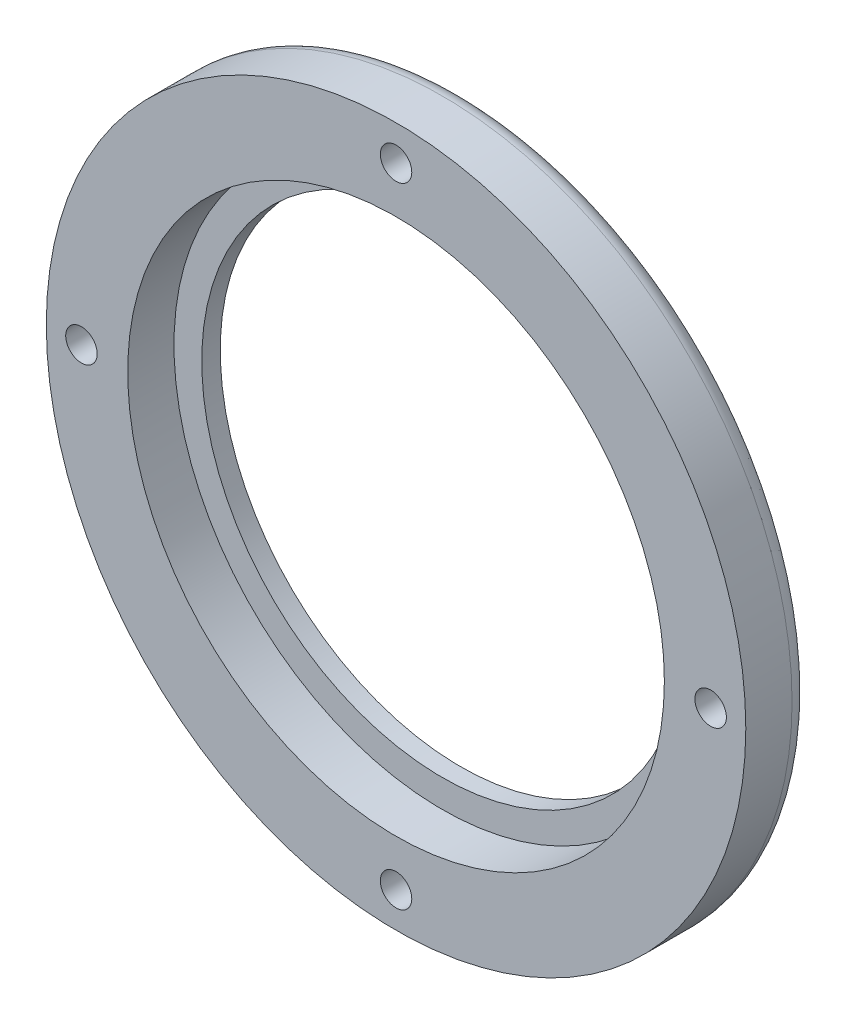
ISO-10303-21;
HEADER;
FILE_DESCRIPTION(('STEP AP214'),'2;1');
FILE_NAME('part.step','',(''),(''),'','','');
FILE_SCHEMA(('AUTOMOTIVE_DESIGN { 1 0 10303 214 1 1 1 1 }'));
ENDSEC;
DATA;
#1=APPLICATION_CONTEXT('core data for automotive mechanical design processes');
#2=APPLICATION_PROTOCOL_DEFINITION('international standard','automotive_design',2000,#1);
#3=PRODUCT_CONTEXT('',#1,'mechanical');
#4=PRODUCT('Part','Part','',(#3));
#5=PRODUCT_RELATED_PRODUCT_CATEGORY('part','',(#4));
#6=PRODUCT_DEFINITION_FORMATION('','',#4);
#7=PRODUCT_DEFINITION_CONTEXT('part definition',#1,'design');
#8=PRODUCT_DEFINITION('design','',#6,#7);
#9=PRODUCT_DEFINITION_SHAPE('','',#8);
#10=(LENGTH_UNIT() NAMED_UNIT(*) SI_UNIT(.MILLI.,.METRE.));
#11=(NAMED_UNIT(*) PLANE_ANGLE_UNIT() SI_UNIT($,.RADIAN.));
#12=(NAMED_UNIT(*) SI_UNIT($,.STERADIAN.) SOLID_ANGLE_UNIT());
#13=UNCERTAINTY_MEASURE_WITH_UNIT(LENGTH_MEASURE(1.E-05),#10,'distance_accuracy_value','');
#14=(GEOMETRIC_REPRESENTATION_CONTEXT(3) GLOBAL_UNCERTAINTY_ASSIGNED_CONTEXT((#13)) GLOBAL_UNIT_ASSIGNED_CONTEXT((#10,
#11,#12)) REPRESENTATION_CONTEXT('',''));
#15=CARTESIAN_POINT('',(0.,0.,0.));
#16=DIRECTION('',(0.,0.,1.));
#17=DIRECTION('',(1.,0.,0.));
#18=AXIS2_PLACEMENT_3D('',#15,#16,#17);
#19=CARTESIAN_POINT('',(34.,-3.58906191348806E-13,-1.));
#20=DIRECTION('',(0.,0.,1.));
#21=DIRECTION('',(1.,0.,0.));
#22=AXIS2_PLACEMENT_3D('',#19,#20,#21);
#23=CYLINDRICAL_SURFACE('',#22,1.7);
#24=CARTESIAN_POINT('',(34.,-3.58906191348806E-13,7.));
#25=DIRECTION('',(0.,0.,1.));
#26=DIRECTION('',(1.,0.,0.));
#27=AXIS2_PLACEMENT_3D('',#24,#25,#26);
#28=CIRCLE('',#27,1.7);
#29=CARTESIAN_POINT('',(35.7,-3.58906191348806E-13,7.));
#30=VERTEX_POINT('',#29);
#31=EDGE_CURVE('E142',#30,#30,#28,.T.);
#32=ORIENTED_EDGE('',*,*,#31,.T.);
#33=EDGE_LOOP('',(#32));
#34=FACE_BOUND('',#33,.T.);
#35=CARTESIAN_POINT('',(34.,-3.58906191348806E-13,2.5));
#36=DIRECTION('',(0.,0.,-1.));
#37=DIRECTION('',(-1.,0.,0.));
#38=AXIS2_PLACEMENT_3D('',#35,#36,#37);
#39=CIRCLE('',#38,1.7);
#40=CARTESIAN_POINT('',(32.3,-3.58906191348806E-13,2.5));
#41=VERTEX_POINT('',#40);
#42=EDGE_CURVE('E139',#41,#41,#39,.F.);
#43=ORIENTED_EDGE('',*,*,#42,.F.);
#44=EDGE_LOOP('',(#43));
#45=FACE_BOUND('',#44,.T.);
#46=ADVANCED_FACE('F42',(#34,#45),#23,.F.);
#47=CARTESIAN_POINT('',(2.33256931924232E-13,34.,-1.));
#48=DIRECTION('',(0.,0.,1.));
#49=DIRECTION('',(1.,0.,0.));
#50=AXIS2_PLACEMENT_3D('',#47,#48,#49);
#51=CYLINDRICAL_SURFACE('',#50,1.7);
#52=CARTESIAN_POINT('',(2.33256931924232E-13,34.,7.));
#53=DIRECTION('',(0.,0.,1.));
#54=DIRECTION('',(1.,0.,0.));
#55=AXIS2_PLACEMENT_3D('',#52,#53,#54);
#56=CIRCLE('',#55,1.7);
#57=CARTESIAN_POINT('',(1.70000000000023,34.,7.));
#58=VERTEX_POINT('',#57);
#59=EDGE_CURVE('E234',#58,#58,#56,.T.);
#60=ORIENTED_EDGE('',*,*,#59,.T.);
#61=EDGE_LOOP('',(#60));
#62=FACE_BOUND('',#61,.T.);
#63=CARTESIAN_POINT('',(2.33256931924232E-13,34.,2.5));
#64=DIRECTION('',(0.,0.,-1.));
#65=DIRECTION('',(-1.,0.,0.));
#66=AXIS2_PLACEMENT_3D('',#63,#64,#65);
#67=CIRCLE('',#66,1.7);
#68=CARTESIAN_POINT('',(-1.69999999999977,34.,2.5));
#69=VERTEX_POINT('',#68);
#70=EDGE_CURVE('E135',#69,#69,#67,.F.);
#71=ORIENTED_EDGE('',*,*,#70,.F.);
#72=EDGE_LOOP('',(#71));
#73=FACE_BOUND('',#72,.T.);
#74=ADVANCED_FACE('F171',(#62,#73),#51,.F.);
#75=CARTESIAN_POINT('',(-34.,1.21485460307473E-13,-1.));
#76=DIRECTION('',(0.,0.,1.));
#77=DIRECTION('',(1.,0.,0.));
#78=AXIS2_PLACEMENT_3D('',#75,#76,#77);
#79=CYLINDRICAL_SURFACE('',#78,1.7);
#80=CARTESIAN_POINT('',(-34.,1.21485460307473E-13,7.));
#81=DIRECTION('',(0.,0.,1.));
#82=DIRECTION('',(1.,0.,0.));
#83=AXIS2_PLACEMENT_3D('',#80,#81,#82);
#84=CIRCLE('',#83,1.7);
#85=CARTESIAN_POINT('',(-32.3,1.21485460307473E-13,7.));
#86=VERTEX_POINT('',#85);
#87=EDGE_CURVE('E238',#86,#86,#84,.T.);
#88=ORIENTED_EDGE('',*,*,#87,.T.);
#89=EDGE_LOOP('',(#88));
#90=FACE_BOUND('',#89,.T.);
#91=CARTESIAN_POINT('',(-34.,1.21485460307473E-13,2.5));
#92=DIRECTION('',(0.,0.,-1.));
#93=DIRECTION('',(-1.,0.,0.));
#94=AXIS2_PLACEMENT_3D('',#91,#92,#93);
#95=CIRCLE('',#94,1.7);
#96=CARTESIAN_POINT('',(-35.7,1.21485460307473E-13,2.5));
#97=VERTEX_POINT('',#96);
#98=EDGE_CURVE('E130',#97,#97,#95,.F.);
#99=ORIENTED_EDGE('',*,*,#98,.F.);
#100=EDGE_LOOP('',(#99));
#101=FACE_BOUND('',#100,.T.);
#102=ADVANCED_FACE('F167',(#90,#101),#79,.F.);
#103=CARTESIAN_POINT('',(0.,-34.,-1.));
#104=DIRECTION('',(0.,0.,1.));
#105=DIRECTION('',(1.,0.,0.));
#106=AXIS2_PLACEMENT_3D('',#103,#104,#105);
#107=CYLINDRICAL_SURFACE('',#106,1.7);
#108=CARTESIAN_POINT('',(0.,-34.,7.));
#109=DIRECTION('',(0.,0.,1.));
#110=DIRECTION('',(1.,0.,0.));
#111=AXIS2_PLACEMENT_3D('',#108,#109,#110);
#112=CIRCLE('',#111,1.7);
#113=CARTESIAN_POINT('',(1.7,-34.,7.));
#114=VERTEX_POINT('',#113);
#115=EDGE_CURVE('E229',#114,#114,#112,.T.);
#116=ORIENTED_EDGE('',*,*,#115,.T.);
#117=EDGE_LOOP('',(#116));
#118=FACE_BOUND('',#117,.T.);
#119=CARTESIAN_POINT('',(0.,-34.,2.5));
#120=DIRECTION('',(0.,0.,-1.));
#121=DIRECTION('',(-1.,0.,0.));
#122=AXIS2_PLACEMENT_3D('',#119,#120,#121);
#123=CIRCLE('',#122,1.7);
#124=CARTESIAN_POINT('',(-1.7,-34.,2.5));
#125=VERTEX_POINT('',#124);
#126=EDGE_CURVE('E126',#125,#125,#123,.F.);
#127=ORIENTED_EDGE('',*,*,#126,.F.);
#128=EDGE_LOOP('',(#127));
#129=FACE_BOUND('',#128,.T.);
#130=ADVANCED_FACE('F163',(#118,#129),#107,.F.);
#131=CARTESIAN_POINT('',(0.,0.,7.));
#132=DIRECTION('',(0.,0.,-1.));
#133=DIRECTION('',(-1.,0.,0.));
#134=AXIS2_PLACEMENT_3D('',#131,#132,#133);
#135=CYLINDRICAL_SURFACE('',#134,26.);
#136=CARTESIAN_POINT('',(0.,0.,0.));
#137=DIRECTION('',(0.,0.,1.));
#138=DIRECTION('',(1.,0.,0.));
#139=AXIS2_PLACEMENT_3D('',#136,#137,#138);
#140=CIRCLE('',#139,26.);
#141=CARTESIAN_POINT('',(26.,0.,0.));
#142=VERTEX_POINT('',#141);
#143=EDGE_CURVE('E208',#142,#142,#140,.T.);
#144=ORIENTED_EDGE('',*,*,#143,.F.);
#145=EDGE_LOOP('',(#144));
#146=FACE_BOUND('',#145,.T.);
#147=CARTESIAN_POINT('',(0.,0.,2.));
#148=DIRECTION('',(0.,0.,1.));
#149=DIRECTION('',(1.,0.,0.));
#150=AXIS2_PLACEMENT_3D('',#147,#148,#149);
#151=CIRCLE('',#150,26.);
#152=CARTESIAN_POINT('',(26.,0.,2.));
#153=VERTEX_POINT('',#152);
#154=EDGE_CURVE('E213',#153,#153,#151,.T.);
#155=ORIENTED_EDGE('',*,*,#154,.T.);
#156=EDGE_LOOP('',(#155));
#157=FACE_BOUND('',#156,.T.);
#158=ADVANCED_FACE('F166',(#146,#157),#135,.F.);
#159=CARTESIAN_POINT('',(0.,0.,7.));
#160=DIRECTION('',(0.,0.,1.));
#161=DIRECTION('',(1.,0.,0.));
#162=AXIS2_PLACEMENT_3D('',#159,#160,#161);
#163=PLANE('',#162);
#164=ORIENTED_EDGE('',*,*,#115,.F.);
#165=EDGE_LOOP('',(#164));
#166=FACE_BOUND('',#165,.T.);
#167=ORIENTED_EDGE('',*,*,#87,.F.);
#168=EDGE_LOOP('',(#167));
#169=FACE_BOUND('',#168,.T.);
#170=ORIENTED_EDGE('',*,*,#59,.F.);
#171=EDGE_LOOP('',(#170));
#172=FACE_BOUND('',#171,.T.);
#173=ORIENTED_EDGE('',*,*,#31,.F.);
#174=EDGE_LOOP('',(#173));
#175=FACE_BOUND('',#174,.T.);
#176=CARTESIAN_POINT('',(0.,0.,7.));
#177=DIRECTION('',(0.,0.,1.));
#178=DIRECTION('',(1.,0.,0.));
#179=AXIS2_PLACEMENT_3D('',#176,#177,#178);
#180=CIRCLE('',#179,29.);
#181=CARTESIAN_POINT('',(29.,0.,7.));
#182=VERTEX_POINT('',#181);
#183=EDGE_CURVE('E223',#182,#182,#180,.T.);
#184=ORIENTED_EDGE('',*,*,#183,.F.);
#185=EDGE_LOOP('',(#184));
#186=FACE_BOUND('',#185,.T.);
#187=CARTESIAN_POINT('',(0.,0.,7.));
#188=DIRECTION('',(0.,0.,1.));
#189=DIRECTION('',(1.,0.,0.));
#190=AXIS2_PLACEMENT_3D('',#187,#188,#189);
#191=CIRCLE('',#190,37.8);
#192=CARTESIAN_POINT('',(37.8,0.,7.));
#193=VERTEX_POINT('',#192);
#194=EDGE_CURVE('E205',#193,#193,#191,.T.);
#195=ORIENTED_EDGE('',*,*,#194,.T.);
#196=EDGE_LOOP('',(#195));
#197=FACE_BOUND('',#196,.T.);
#198=ADVANCED_FACE('F190',(#166,#169,#172,#175,#186,#197),#163,.T.);
#199=CARTESIAN_POINT('',(0.,0.,0.));
#200=DIRECTION('',(0.,0.,1.));
#201=DIRECTION('',(1.,0.,0.));
#202=AXIS2_PLACEMENT_3D('',#199,#200,#201);
#203=PLANE('',#202);
#204=CARTESIAN_POINT('',(0.,0.,0.));
#205=DIRECTION('',(0.,0.,1.));
#206=DIRECTION('',(1.,0.,0.));
#207=AXIS2_PLACEMENT_3D('',#204,#205,#206);
#208=CIRCLE('',#207,35.8);
#209=CARTESIAN_POINT('',(2.33193597915998,35.7239705882353,0.));
#210=VERTEX_POINT('',#209);
#211=CARTESIAN_POINT('',(35.7239705882353,2.33193597915935,0.));
#212=VERTEX_POINT('',#211);
#213=EDGE_CURVE('E120',#210,#212,#208,.F.);
#214=ORIENTED_EDGE('',*,*,#213,.T.);
#215=CARTESIAN_POINT('',(34.,-3.58906191348806E-13,0.));
#216=DIRECTION('',(0.,0.,-1.));
#217=DIRECTION('',(-1.,0.,0.));
#218=AXIS2_PLACEMENT_3D('',#215,#216,#217);
#219=CIRCLE('',#218,2.9);
#220=CARTESIAN_POINT('',(35.7239705882353,-2.33193597916011,0.));
#221=VERTEX_POINT('',#220);
#222=EDGE_CURVE('E62',#221,#212,#219,.T.);
#223=ORIENTED_EDGE('',*,*,#222,.F.);
#224=CARTESIAN_POINT('',(2.33193597915974,-35.7239705882353,0.));
#225=VERTEX_POINT('',#224);
#226=EDGE_CURVE('E99',#221,#225,#208,.F.);
#227=ORIENTED_EDGE('',*,*,#226,.T.);
#228=CARTESIAN_POINT('',(0.,-34.,0.));
#229=DIRECTION('',(0.,0.,-1.));
#230=DIRECTION('',(-1.,0.,0.));
#231=AXIS2_PLACEMENT_3D('',#228,#229,#230);
#232=CIRCLE('',#231,2.9);
#233=CARTESIAN_POINT('',(-2.33193597915973,-35.7239705882353,0.));
#234=VERTEX_POINT('',#233);
#235=EDGE_CURVE('E92',#234,#225,#232,.T.);
#236=ORIENTED_EDGE('',*,*,#235,.F.);
#237=CARTESIAN_POINT('',(-35.7239705882353,-2.33193597915961,0.));
#238=VERTEX_POINT('',#237);
#239=EDGE_CURVE('E107',#234,#238,#208,.F.);
#240=ORIENTED_EDGE('',*,*,#239,.T.);
#241=CARTESIAN_POINT('',(-34.,1.21485460307473E-13,0.));
#242=DIRECTION('',(0.,0.,-1.));
#243=DIRECTION('',(-1.,0.,0.));
#244=AXIS2_PLACEMENT_3D('',#241,#242,#243);
#245=CIRCLE('',#244,2.9);
#246=CARTESIAN_POINT('',(-35.7239705882353,2.33193597915986,0.));
#247=VERTEX_POINT('',#246);
#248=EDGE_CURVE('E251',#247,#238,#245,.T.);
#249=ORIENTED_EDGE('',*,*,#248,.F.);
#250=CARTESIAN_POINT('',(-2.33193597915948,35.7239705882353,0.));
#251=VERTEX_POINT('',#250);
#252=EDGE_CURVE('E116',#247,#251,#208,.F.);
#253=ORIENTED_EDGE('',*,*,#252,.T.);
#254=CARTESIAN_POINT('',(2.40195825828139E-13,34.,0.));
#255=DIRECTION('',(0.,0.,-1.));
#256=DIRECTION('',(-1.,0.,0.));
#257=AXIS2_PLACEMENT_3D('',#254,#255,#256);
#258=CIRCLE('',#257,2.9);
#259=EDGE_CURVE('E69',#210,#251,#258,.T.);
#260=ORIENTED_EDGE('',*,*,#259,.F.);
#261=EDGE_LOOP('',(#214,#223,#227,#236,#240,#249,#253,#260));
#262=FACE_BOUND('',#261,.T.);
#263=ORIENTED_EDGE('',*,*,#143,.T.);
#264=EDGE_LOOP('',(#263));
#265=FACE_BOUND('',#264,.T.);
#266=ADVANCED_FACE('F104',(#262,#265),#203,.F.);
#267=CARTESIAN_POINT('',(0.,0.,7.));
#268=DIRECTION('',(0.,0.,-1.));
#269=DIRECTION('',(-1.,0.,0.));
#270=AXIS2_PLACEMENT_3D('',#267,#268,#269);
#271=CYLINDRICAL_SURFACE('',#270,37.8);
#272=CARTESIAN_POINT('',(0.,0.,2.));
#273=DIRECTION('',(0.,0.,1.));
#274=DIRECTION('',(1.,0.,0.));
#275=AXIS2_PLACEMENT_3D('',#272,#273,#274);
#276=CIRCLE('',#275,37.8);
#277=CARTESIAN_POINT('',(37.8,0.,2.));
#278=VERTEX_POINT('',#277);
#279=EDGE_CURVE('E124',#278,#278,#276,.T.);
#280=ORIENTED_EDGE('',*,*,#279,.T.);
#281=EDGE_LOOP('',(#280));
#282=FACE_BOUND('',#281,.T.);
#283=ORIENTED_EDGE('',*,*,#194,.F.);
#284=EDGE_LOOP('',(#283));
#285=FACE_BOUND('',#284,.T.);
#286=ADVANCED_FACE('F186',(#282,#285),#271,.T.);
#287=CARTESIAN_POINT('',(0.,0.,2.));
#288=DIRECTION('',(0.,0.,1.));
#289=DIRECTION('',(1.,0.,0.));
#290=AXIS2_PLACEMENT_3D('',#287,#288,#289);
#291=CYLINDRICAL_SURFACE('',#290,29.);
#292=CARTESIAN_POINT('',(0.,0.,2.));
#293=DIRECTION('',(0.,0.,1.));
#294=DIRECTION('',(1.,0.,0.));
#295=AXIS2_PLACEMENT_3D('',#292,#293,#294);
#296=CIRCLE('',#295,29.);
#297=CARTESIAN_POINT('',(29.,0.,2.));
#298=VERTEX_POINT('',#297);
#299=EDGE_CURVE('E218',#298,#298,#296,.T.);
#300=ORIENTED_EDGE('',*,*,#299,.F.);
#301=EDGE_LOOP('',(#300));
#302=FACE_BOUND('',#301,.T.);
#303=ORIENTED_EDGE('',*,*,#183,.T.);
#304=EDGE_LOOP('',(#303));
#305=FACE_BOUND('',#304,.T.);
#306=ADVANCED_FACE('F182',(#302,#305),#291,.F.);
#307=CARTESIAN_POINT('',(0.,0.,2.));
#308=DIRECTION('',(0.,0.,1.));
#309=DIRECTION('',(1.,0.,0.));
#310=AXIS2_PLACEMENT_3D('',#307,#308,#309);
#311=PLANE('',#310);
#312=ORIENTED_EDGE('',*,*,#154,.F.);
#313=EDGE_LOOP('',(#312));
#314=FACE_BOUND('',#313,.T.);
#315=ORIENTED_EDGE('',*,*,#299,.T.);
#316=EDGE_LOOP('',(#315));
#317=FACE_BOUND('',#316,.T.);
#318=ADVANCED_FACE('F179',(#314,#317),#311,.T.);
#319=CARTESIAN_POINT('',(0.,0.,2.));
#320=DIRECTION('',(0.,0.,1.));
#321=DIRECTION('',(1.,0.,0.));
#322=AXIS2_PLACEMENT_3D('',#319,#320,#321);
#323=TOROIDAL_SURFACE('',#322,35.8,2.);
#324=CARTESIAN_POINT('',(33.6769117746471,2.8819462171658,2.0002));
#325=CARTESIAN_POINT('',(33.6769019662557,2.88193301000173,1.94412417231844));
#326=CARTESIAN_POINT('',(33.6792451408607,2.88220749489008,1.88805087356838));
#327=CARTESIAN_POINT('',(33.6886040835122,2.88324005083849,1.77630242565175));
#328=CARTESIAN_POINT('',(33.6956196453491,2.88399810055698,1.72062725902374));
#329=CARTESIAN_POINT('',(33.7142923925436,2.88590624827923,1.61004895021777));
#330=CARTESIAN_POINT('',(33.7259507695862,2.88705644692609,1.55514600999811));
#331=CARTESIAN_POINT('',(33.7538296562477,2.88956640692947,1.44653236546983));
#332=CARTESIAN_POINT('',(33.7700501259912,2.89092616645425,1.39282165074489));
#333=CARTESIAN_POINT('',(33.8254599332222,2.89498384776472,1.23397289324904));
#334=CARTESIAN_POINT('',(33.8714016597399,2.89766075449593,1.13109463670949));
#335=CARTESIAN_POINT('',(33.9800686548637,2.90043711895356,0.934671848108845));
#336=CARTESIAN_POINT('',(34.0427867993572,2.90053766898072,0.841123377246145));
#337=CARTESIAN_POINT('',(34.1820014481896,2.89510484278048,0.667628417655143));
#338=CARTESIAN_POINT('',(34.2582459035088,2.88966710500999,0.587477932945119));
#339=CARTESIAN_POINT('',(34.4224236673637,2.8702538128241,0.441476697976109));
#340=CARTESIAN_POINT('',(34.5103487557854,2.85628423794836,0.375615976506834));
#341=CARTESIAN_POINT('',(34.6872451281448,2.81873268692289,0.264208182114245));
#342=CARTESIAN_POINT('',(34.7756689291825,2.79592900464463,0.217527218175826));
#343=CARTESIAN_POINT('',(34.9554368545129,2.73970761364595,0.138422687999119));
#344=CARTESIAN_POINT('',(35.0467804364244,2.70629186604597,0.105996490103349));
#345=CARTESIAN_POINT('',(35.2257459468278,2.62996461921755,0.0555102071498546));
#346=CARTESIAN_POINT('',(35.3133938128686,2.58738910284884,0.0370258304653582));
#347=CARTESIAN_POINT('',(35.4851388077337,2.49278955528153,0.0112278713577212));
#348=CARTESIAN_POINT('',(35.5692338021015,2.44075994110505,0.00392091373722555));
#349=CARTESIAN_POINT('',(35.7614162865745,2.30771825669873,-0.00246648493779885));
#350=CARTESIAN_POINT('',(35.8671045738612,2.22304795389405,0.00241210886987915));
#351=CARTESIAN_POINT('',(36.0650343659469,2.04055188822127,0.0239393173129992));
#352=CARTESIAN_POINT('',(36.1572553943144,1.94270651850603,0.0406056344699227));
#353=CARTESIAN_POINT('',(36.3281921493637,1.73435280474962,0.0809616786448039));
#354=CARTESIAN_POINT('',(36.4066495797893,1.62365631720821,0.104766783330279));
#355=CARTESIAN_POINT('',(36.5472672707067,1.39275013737489,0.154345977257815));
#356=CARTESIAN_POINT('',(36.6094163358502,1.27253398334834,0.180121403490907));
#357=CARTESIAN_POINT('',(36.7280349705352,0.997360061274029,0.234050889498394));
#358=CARTESIAN_POINT('',(36.78045779823,0.840465338297592,0.261537544079876));
#359=CARTESIAN_POINT('',(36.8386198604133,0.599246685996718,0.293621711925992));
#360=CARTESIAN_POINT('',(36.8545939128901,0.517879694972608,0.302791114202787));
#361=CARTESIAN_POINT('',(36.8795411833824,0.353724976117443,0.31734893495778));
#362=CARTESIAN_POINT('',(36.8885157369704,0.270937522407029,0.322738074727038));
#363=CARTESIAN_POINT('',(36.8988814046875,0.111261875014332,0.328984131795167));
#364=CARTESIAN_POINT('',(36.9008124074433,0.0344206223566678,0.330163554898558));
#365=CARTESIAN_POINT('',(36.8985688378572,-0.119138812313803,0.328802436745329));
#366=CARTESIAN_POINT('',(36.8943944356401,-0.195856997696201,0.326261999141218));
#367=CARTESIAN_POINT('',(36.8799997421531,-0.34854347948866,0.317658307417866));
#368=CARTESIAN_POINT('',(36.869777770833,-0.424511561550919,0.311594074375996));
#369=CARTESIAN_POINT('',(36.8434299096998,-0.575117372900177,0.296406222122173));
#370=CARTESIAN_POINT('',(36.8273013690133,-0.649754489051289,0.287281229393521));
#371=CARTESIAN_POINT('',(36.7730140253608,-0.860444843406485,0.25773018292704));
#372=CARTESIAN_POINT('',(36.7278196570245,-0.99432901614525,0.234320017668296));
#373=CARTESIAN_POINT('',(36.6188345462308,-1.25362316519998,0.184101590821938));
#374=CARTESIAN_POINT('',(36.555021958478,-1.37902297241905,0.157289358494792));
#375=CARTESIAN_POINT('',(36.3982013017103,-1.63859918350332,0.101562124716004));
#376=CARTESIAN_POINT('',(36.3021860726778,-1.77107455572553,0.0729754016640827));
#377=CARTESIAN_POINT('',(36.1417859084915,-1.95689974771047,0.0386535757255));
#378=CARTESIAN_POINT('',(36.0856100669992,-2.01667656410821,0.0286411656397888));
#379=CARTESIAN_POINT('',(35.9681108550976,-2.13149733417604,0.0126168221998489));
#380=CARTESIAN_POINT('',(35.9067901519978,-2.18654371070188,0.00660283015736552));
#381=CARTESIAN_POINT('',(35.755714834184,-2.31089847962317,-0.00148630891377015));
#382=CARTESIAN_POINT('',(35.663875389275,-2.3778842804981,-0.00126065011129347));
#383=CARTESIAN_POINT('',(35.4736479887821,-2.50022468622822,0.0121846580858508));
#384=CARTESIAN_POINT('',(35.3752663788109,-2.55559035151189,0.0253918825048772));
#385=CARTESIAN_POINT('',(35.1746318908158,-2.65382605117189,0.0677189568998372));
#386=CARTESIAN_POINT('',(35.0723551280056,-2.69659710079714,0.0969599457270315));
#387=CARTESIAN_POINT('',(34.8696153462467,-2.76863397231282,0.173097896656812));
#388=CARTESIAN_POINT('',(34.7691514534282,-2.79790647767133,0.219986100248817));
#389=CARTESIAN_POINT('',(34.5869003511555,-2.84135348464916,0.324630182397839));
#390=CARTESIAN_POINT('',(34.5043114640715,-2.85690726812083,0.38043653603006));
#391=CARTESIAN_POINT('',(34.3478421553684,-2.88015070698599,0.504486186323146));
#392=CARTESIAN_POINT('',(34.2739623214124,-2.88783983196226,0.572730321461326));
#393=CARTESIAN_POINT('',(34.1374598466828,-2.89754967630448,0.719762604287764));
#394=CARTESIAN_POINT('',(34.0748189902853,-2.89957964685767,0.798533322644665));
#395=CARTESIAN_POINT('',(33.9622470890663,-2.90030191347589,0.964729197271115));
#396=CARTESIAN_POINT('',(33.9123230788325,-2.89899236660847,1.05215910657726));
#397=CARTESIAN_POINT('',(33.8230256235635,-2.89496758498431,1.24044629071295));
#398=CARTESIAN_POINT('',(33.7847443723196,-2.89215294958475,1.34181906425014));
#399=CARTESIAN_POINT('',(33.7250931545763,-2.88709792927767,1.54936577281653));
#400=CARTESIAN_POINT('',(33.7037039848247,-2.88485689425535,1.65553411051295));
#401=CARTESIAN_POINT('',(33.6862768057638,-2.88298287162753,1.80207369232352));
#402=CARTESIAN_POINT('',(33.6827594883142,-2.88259662478854,1.84165199135714));
#403=CARTESIAN_POINT('',(33.6780779086529,-2.88207779659807,1.92088168377782));
#404=CARTESIAN_POINT('',(33.6769096556318,-2.88194478504737,1.96053283845396));
#405=CARTESIAN_POINT('',(33.676911774647,-2.88194621716651,2.0002));
#406=B_SPLINE_CURVE_WITH_KNOTS('',3,(#324,#325,#326,#327,#328,#329,#330,#331,#332,#333,#334,
#335,#336,#337,#338,#339,#340,#341,#342,#343,#344,#345,#346,#347,#348,#349,#350,#351,#352,#353,
#354,#355,#356,#357,#358,#359,#360,#361,#362,#363,#364,#365,#366,#367,#368,#369,#370,#371,#372,
#373,#374,#375,#376,#377,#378,#379,#380,#381,#382,#383,#384,#385,#386,#387,#388,#389,#390,#391,
#392,#393,#394,#395,#396,#397,#398,#399,#400,#401,#402,#403,#404,#405),.UNSPECIFIED.,.F.,.F.,(4,
2,2,2,2,2,2,2,2,2,2,2,2,2,2,2,2,2,2,2,2,2,2,2,2,2,2,2,2,2,2,2,2,2,2,2,2,2,2,2,4),(0.,
0.168172668836522,0.336337916081387,0.504546354641972,0.672753323006579,1.00909633501532,
1.34529674495413,1.67578827012788,2.00604843562876,2.31213883323093,2.61817269790118,
2.91446871813939,3.2109402836569,3.61524957654571,4.02016734426764,4.43201866556609,
4.84415197879983,5.34429206739958,5.59425151477456,5.84416325578209,6.07446129342222,
6.30475291401701,6.53510854103149,6.76556767879838,7.19348013654633,7.62189670947092,
8.11740608465621,8.36500359067312,8.61247351582398,8.95209974026211,9.29140121631262,
9.63330224016668,9.97503379799771,10.2762190388284,10.5774245911966,10.8781374643884,
11.1790163236668,11.5027949710981,11.8262050085829,11.9453593553058,12.0643110999128),.UNSPECIFIED.);
#407=EDGE_CURVE('E11',#212,#221,#406,.T.);
#408=ORIENTED_EDGE('',*,*,#407,.F.);
#409=ORIENTED_EDGE('',*,*,#213,.F.);
#410=CARTESIAN_POINT('',(-2.88194621716591,33.6769117746471,2.0002));
#411=CARTESIAN_POINT('',(-2.88193301000185,33.6769019662557,1.94412417231844));
#412=CARTESIAN_POINT('',(-2.88220749489019,33.6792451408607,1.88805087356838));
#413=CARTESIAN_POINT('',(-2.8832400508386,33.6886040835122,1.77630242565176));
#414=CARTESIAN_POINT('',(-2.8839981005571,33.6956196453491,1.72062725902374));
#415=CARTESIAN_POINT('',(-2.88590624827935,33.7142923925435,1.61004895021777));
#416=CARTESIAN_POINT('',(-2.88705644692621,33.7259507695862,1.55514600999811));
#417=CARTESIAN_POINT('',(-2.88956640692959,33.7538296562477,1.44653236546984));
#418=CARTESIAN_POINT('',(-2.89092616645437,33.7700501259912,1.3928216507449));
#419=CARTESIAN_POINT('',(-2.89498384776484,33.8254599332222,1.23397289324904));
#420=CARTESIAN_POINT('',(-2.89766075449605,33.8714016597399,1.13109463670949));
#421=CARTESIAN_POINT('',(-2.90043711895368,33.9800686548636,0.934671848108849));
#422=CARTESIAN_POINT('',(-2.90053766898084,34.0427867993571,0.841123377246148));
#423=CARTESIAN_POINT('',(-2.89510484278061,34.1820014481895,0.667628417655147));
#424=CARTESIAN_POINT('',(-2.88966710501011,34.2582459035088,0.587477932945127));
#425=CARTESIAN_POINT('',(-2.87025381282422,34.4224236673637,0.441476697976114));
#426=CARTESIAN_POINT('',(-2.85628423794848,34.5103487557854,0.375615976506833));
#427=CARTESIAN_POINT('',(-2.81873268692301,34.6872451281448,0.264208182114241));
#428=CARTESIAN_POINT('',(-2.79592900464475,34.7756689291825,0.217527218175822));
#429=CARTESIAN_POINT('',(-2.73970761364607,34.9554368545129,0.138422687999117));
#430=CARTESIAN_POINT('',(-2.70629186604609,35.0467804364244,0.10599649010335));
#431=CARTESIAN_POINT('',(-2.62996461921767,35.2257459468278,0.0555102071498547));
#432=CARTESIAN_POINT('',(-2.58738910284896,35.3133938128686,0.037025830465357));
#433=CARTESIAN_POINT('',(-2.49278955528165,35.4851388077337,0.0112278713577195));
#434=CARTESIAN_POINT('',(-2.44075994110517,35.5692338021015,0.00392091373722481));
#435=CARTESIAN_POINT('',(-2.30771825669886,35.7614162865745,-0.00246648493779842));
#436=CARTESIAN_POINT('',(-2.22304795389417,35.8671045738612,0.0024121088698798));
#437=CARTESIAN_POINT('',(-2.04055188822139,36.0650343659469,0.0239393173130005));
#438=CARTESIAN_POINT('',(-1.94270651850615,36.1572553943144,0.0406056344699243));
#439=CARTESIAN_POINT('',(-1.73435280474974,36.3281921493637,0.0809616786448061));
#440=CARTESIAN_POINT('',(-1.62365631720832,36.4066495797893,0.104766783330282));
#441=CARTESIAN_POINT('',(-1.392750137375,36.5472672707067,0.15434597725782));
#442=CARTESIAN_POINT('',(-1.27253398334845,36.6094163358502,0.180121403490913));
#443=CARTESIAN_POINT('',(-0.997360061274138,36.7280349705353,0.234050889498399));
#444=CARTESIAN_POINT('',(-0.840465338297702,36.78045779823,0.261537544079879));
#445=CARTESIAN_POINT('',(-0.599246685996829,36.8386198604133,0.293621711925993));
#446=CARTESIAN_POINT('',(-0.517879694972719,36.8545939128901,0.302791114202788));
#447=CARTESIAN_POINT('',(-0.353724976117556,36.8795411833824,0.317348934957781));
#448=CARTESIAN_POINT('',(-0.270937522407144,36.8885157369704,0.322738074727039));
#449=CARTESIAN_POINT('',(-0.111261875014448,36.8988814046875,0.328984131795167));
#450=CARTESIAN_POINT('',(-0.0344206223567841,36.9008124074433,0.330163554898558));
#451=CARTESIAN_POINT('',(0.119138812313687,36.8985688378572,0.32880243674533));
#452=CARTESIAN_POINT('',(0.195856997696085,36.8943944356401,0.326261999141218));
#453=CARTESIAN_POINT('',(0.348543479488544,36.8799997421531,0.317658307417867));
#454=CARTESIAN_POINT('',(0.424511561550802,36.869777770833,0.311594074375998));
#455=CARTESIAN_POINT('',(0.57511737290006,36.8434299096998,0.296406222122172));
#456=CARTESIAN_POINT('',(0.649754489051171,36.8273013690133,0.287281229393518));
#457=CARTESIAN_POINT('',(0.860444843406367,36.7730140253608,0.257730182927034));
#458=CARTESIAN_POINT('',(0.994329016145133,36.7278196570245,0.23432001766829));
#459=CARTESIAN_POINT('',(1.25362316519986,36.6188345462308,0.184101590821936));
#460=CARTESIAN_POINT('',(1.37902297241893,36.555021958478,0.157289358494791));
#461=CARTESIAN_POINT('',(1.63859918350321,36.3982013017103,0.101562124716004));
#462=CARTESIAN_POINT('',(1.77107455572541,36.3021860726778,0.0729754016640805));
#463=CARTESIAN_POINT('',(1.95689974771035,36.1417859084915,0.0386535757254981));
#464=CARTESIAN_POINT('',(2.01667656410809,36.0856100669992,0.0286411656397875));
#465=CARTESIAN_POINT('',(2.13149733417592,35.9681108550976,0.012616822199848));
#466=CARTESIAN_POINT('',(2.18654371070176,35.9067901519978,0.00660283015736433));
#467=CARTESIAN_POINT('',(2.31089847962306,35.755714834184,-0.00148630891377046));
#468=CARTESIAN_POINT('',(2.37788428049799,35.663875389275,-0.00126065011129278));
#469=CARTESIAN_POINT('',(2.5002246862281,35.4736479887821,0.012184658085852));
#470=CARTESIAN_POINT('',(2.55559035151177,35.3752663788109,0.0253918825048783));
#471=CARTESIAN_POINT('',(2.65382605117177,35.1746318908158,0.0677189568998382));
#472=CARTESIAN_POINT('',(2.69659710079703,35.0723551280056,0.0969599457270327));
#473=CARTESIAN_POINT('',(2.7686339723127,34.8696153462467,0.173097896656815));
#474=CARTESIAN_POINT('',(2.79790647767121,34.7691514534282,0.219986100248822));
#475=CARTESIAN_POINT('',(2.84135348464904,34.5869003511555,0.324630182397842));
#476=CARTESIAN_POINT('',(2.85690726812071,34.5043114640715,0.380436536030061));
#477=CARTESIAN_POINT('',(2.88015070698587,34.3478421553684,0.504486186323147));
#478=CARTESIAN_POINT('',(2.88783983196214,34.2739623214124,0.57273032146133));
#479=CARTESIAN_POINT('',(2.89754967630436,34.1374598466828,0.719762604287769));
#480=CARTESIAN_POINT('',(2.89957964685755,34.0748189902853,0.79853332264467));
#481=CARTESIAN_POINT('',(2.90030191347578,33.9622470890663,0.96472919727112));
#482=CARTESIAN_POINT('',(2.89899236660835,33.9123230788325,1.05215910657726));
#483=CARTESIAN_POINT('',(2.89496758498419,33.8230256235635,1.24044629071296));
#484=CARTESIAN_POINT('',(2.89215294958464,33.7847443723196,1.34181906425014));
#485=CARTESIAN_POINT('',(2.88709792927755,33.7250931545763,1.54936577281653));
#486=CARTESIAN_POINT('',(2.88485689425523,33.7037039848247,1.65553411051295));
#487=CARTESIAN_POINT('',(2.88298287162741,33.6862768057638,1.80207369232352));
#488=CARTESIAN_POINT('',(2.88259662478843,33.6827594883142,1.84165199135714));
#489=CARTESIAN_POINT('',(2.88207779659795,33.6780779086529,1.92088168377782));
#490=CARTESIAN_POINT('',(2.88194478504725,33.6769096556318,1.96053283845396));
#491=CARTESIAN_POINT('',(2.88194621716639,33.676911774647,2.0002));
#492=B_SPLINE_CURVE_WITH_KNOTS('',3,(#410,#411,#412,#413,#414,#415,#416,#417,#418,#419,#420,
#421,#422,#423,#424,#425,#426,#427,#428,#429,#430,#431,#432,#433,#434,#435,#436,#437,#438,#439,
#440,#441,#442,#443,#444,#445,#446,#447,#448,#449,#450,#451,#452,#453,#454,#455,#456,#457,#458,
#459,#460,#461,#462,#463,#464,#465,#466,#467,#468,#469,#470,#471,#472,#473,#474,#475,#476,#477,
#478,#479,#480,#481,#482,#483,#484,#485,#486,#487,#488,#489,#490,#491),.UNSPECIFIED.,.F.,.F.,(4,
2,2,2,2,2,2,2,2,2,2,2,2,2,2,2,2,2,2,2,2,2,2,2,2,2,2,2,2,2,2,2,2,2,2,2,2,2,2,2,4),(0.,
0.168172668836521,0.336337916081385,0.504546354641973,0.672753323006578,1.00909633501532,
1.34529674495413,1.67578827012787,2.00604843562877,2.31213883323094,2.61817269790119,
2.9144687181394,3.21094028365691,3.61524957654572,4.02016734426766,4.43201866556612,
4.84415197879986,5.34429206739961,5.59425151477458,5.84416325578211,6.07446129342224,
6.30475291401702,6.53510854103151,6.7655676787984,7.19348013654635,7.62189670947094,
8.11740608465623,8.36500359067314,8.612473515824,8.95209974026213,9.29140121631264,
9.6333022401667,9.97503379799772,10.2762190388284,10.5774245911967,10.8781374643884,
11.1790163236668,11.5027949710981,11.8262050085829,11.9453593553058,12.0643110999128),.UNSPECIFIED.);
#493=EDGE_CURVE('E57',#251,#210,#492,.T.);
#494=ORIENTED_EDGE('',*,*,#493,.F.);
#495=ORIENTED_EDGE('',*,*,#252,.F.);
#496=CARTESIAN_POINT('',(-33.6769117746471,-2.88194621716603,2.0002));
#497=CARTESIAN_POINT('',(-33.6769019662557,-2.88193301000197,1.94412417231843));
#498=CARTESIAN_POINT('',(-33.6792451408606,-2.88220749489031,1.88805087356838));
#499=CARTESIAN_POINT('',(-33.6886040835122,-2.88324005083872,1.77630242565175));
#500=CARTESIAN_POINT('',(-33.6956196453491,-2.88399810055722,1.72062725902374));
#501=CARTESIAN_POINT('',(-33.7142923925435,-2.88590624827947,1.61004895021777));
#502=CARTESIAN_POINT('',(-33.7259507695862,-2.88705644692633,1.5551460099981));
#503=CARTESIAN_POINT('',(-33.7538296562477,-2.88956640692971,1.44653236546983));
#504=CARTESIAN_POINT('',(-33.7700501259912,-2.89092616645449,1.39282165074489));
#505=CARTESIAN_POINT('',(-33.8254599332222,-2.89498384776496,1.23397289324904));
#506=CARTESIAN_POINT('',(-33.8714016597399,-2.89766075449617,1.13109463670949));
#507=CARTESIAN_POINT('',(-33.9800686548636,-2.9004371189538,0.934671848108842));
#508=CARTESIAN_POINT('',(-34.0427867993571,-2.90053766898095,0.841123377246136));
#509=CARTESIAN_POINT('',(-34.1820014481895,-2.89510484278072,0.667628417655135));
#510=CARTESIAN_POINT('',(-34.2582459035088,-2.88966710501023,0.587477932945116));
#511=CARTESIAN_POINT('',(-34.4224236673637,-2.87025381282434,0.441476697976104));
#512=CARTESIAN_POINT('',(-34.5103487557854,-2.8562842379486,0.375615976506822));
#513=CARTESIAN_POINT('',(-34.6872451281448,-2.81873268692313,0.264208182114233));
#514=CARTESIAN_POINT('',(-34.7756689291825,-2.79592900464487,0.217527218175818));
#515=CARTESIAN_POINT('',(-34.9554368545129,-2.73970761364619,0.138422687999116));
#516=CARTESIAN_POINT('',(-35.0467804364244,-2.70629186604621,0.105996490103347));
#517=CARTESIAN_POINT('',(-35.2257459468278,-2.6299646192178,0.0555102071498523));
#518=CARTESIAN_POINT('',(-35.3133938128686,-2.58738910284908,0.0370258304653566));
#519=CARTESIAN_POINT('',(-35.4851388077337,-2.49278955528177,0.0112278713577203));
#520=CARTESIAN_POINT('',(-35.5692338021015,-2.4407599411053,0.00392091373722486));
#521=CARTESIAN_POINT('',(-35.7614162865745,-2.30771825669898,-0.00246648493779919));
#522=CARTESIAN_POINT('',(-35.8671045738612,-2.2230479538943,0.00241210886987935));
#523=CARTESIAN_POINT('',(-36.0650343659469,-2.04055188822152,0.0239393173130004));
#524=CARTESIAN_POINT('',(-36.1572553943144,-1.94270651850627,0.0406056344699243));
#525=CARTESIAN_POINT('',(-36.3281921493637,-1.73435280474987,0.080961678644806));
#526=CARTESIAN_POINT('',(-36.4066495797893,-1.62365631720845,0.104766783330281));
#527=CARTESIAN_POINT('',(-36.5472672707067,-1.39275013737514,0.154345977257821));
#528=CARTESIAN_POINT('',(-36.6094163358502,-1.27253398334858,0.180121403490915));
#529=CARTESIAN_POINT('',(-36.7280349705352,-0.997360061274273,0.234050889498399));
#530=CARTESIAN_POINT('',(-36.78045779823,-0.840465338297837,0.261537544079874));
#531=CARTESIAN_POINT('',(-36.8386198604133,-0.599246685996965,0.293621711925993));
#532=CARTESIAN_POINT('',(-36.8545939128901,-0.517879694972856,0.30279111420279));
#533=CARTESIAN_POINT('',(-36.8795411833824,-0.353724976117692,0.317348934957785));
#534=CARTESIAN_POINT('',(-36.8885157369704,-0.270937522407278,0.32273807472704));
#535=CARTESIAN_POINT('',(-36.8988814046875,-0.111261875014582,0.328984131795165));
#536=CARTESIAN_POINT('',(-36.9008124074433,-0.0344206223569182,0.330163554898553));
#537=CARTESIAN_POINT('',(-36.8985688378572,0.119138812313552,0.328802436745326));
#538=CARTESIAN_POINT('',(-36.8943944356401,0.195856997695951,0.326261999141218));
#539=CARTESIAN_POINT('',(-36.8799997421531,0.34854347948841,0.317658307417869));
#540=CARTESIAN_POINT('',(-36.869777770833,0.424511561550668,0.311594074375999));
#541=CARTESIAN_POINT('',(-36.8434299096998,0.575117372899926,0.296406222122174));
#542=CARTESIAN_POINT('',(-36.8273013690133,0.649754489051038,0.28728122939352));
#543=CARTESIAN_POINT('',(-36.7730140253609,0.860444843406233,0.257730182927037));
#544=CARTESIAN_POINT('',(-36.7278196570245,0.994329016144999,0.234320017668294));
#545=CARTESIAN_POINT('',(-36.6188345462308,1.25362316519972,0.184101590821939));
#546=CARTESIAN_POINT('',(-36.555021958478,1.3790229724188,0.157289358494793));
#547=CARTESIAN_POINT('',(-36.3982013017103,1.63859918350307,0.101562124716005));
#548=CARTESIAN_POINT('',(-36.3021860726779,1.77107455572527,0.0729754016640817));
#549=CARTESIAN_POINT('',(-36.1417859084916,1.95689974771022,0.0386535757254997));
#550=CARTESIAN_POINT('',(-36.0856100669992,2.01667656410796,0.0286411656397893));
#551=CARTESIAN_POINT('',(-35.9681108550977,2.13149733417579,0.012616822199849));
#552=CARTESIAN_POINT('',(-35.9067901519979,2.18654371070163,0.00660283015736468));
#553=CARTESIAN_POINT('',(-35.755714834184,2.31089847962293,-0.00148630891377091));
#554=CARTESIAN_POINT('',(-35.663875389275,2.37788428049786,-0.00126065011129297));
#555=CARTESIAN_POINT('',(-35.4736479887821,2.50022468622797,0.0121846580858513));
#556=CARTESIAN_POINT('',(-35.3752663788109,2.55559035151165,0.0253918825048769));
#557=CARTESIAN_POINT('',(-35.1746318908158,2.65382605117165,0.0677189568998368));
#558=CARTESIAN_POINT('',(-35.0723551280056,2.6965971007969,0.0969599457270316));
#559=CARTESIAN_POINT('',(-34.8696153462467,2.76863397231257,0.173097896656813));
#560=CARTESIAN_POINT('',(-34.7691514534282,2.79790647767109,0.219986100248818));
#561=CARTESIAN_POINT('',(-34.5869003511555,2.84135348464892,0.324630182397837));
#562=CARTESIAN_POINT('',(-34.5043114640715,2.85690726812059,0.380436536030055));
#563=CARTESIAN_POINT('',(-34.3478421553684,2.88015070698575,0.504486186323142));
#564=CARTESIAN_POINT('',(-34.2739623214124,2.88783983196202,0.572730321461326));
#565=CARTESIAN_POINT('',(-34.1374598466828,2.89754967630424,0.719762604287767));
#566=CARTESIAN_POINT('',(-34.0748189902853,2.89957964685743,0.798533322644669));
#567=CARTESIAN_POINT('',(-33.9622470890663,2.90030191347566,0.964729197271121));
#568=CARTESIAN_POINT('',(-33.9123230788326,2.89899236660824,1.05215910657726));
#569=CARTESIAN_POINT('',(-33.8230256235635,2.89496758498407,1.24044629071296));
#570=CARTESIAN_POINT('',(-33.7847443723196,2.89215294958452,1.34181906425015));
#571=CARTESIAN_POINT('',(-33.7250931545763,2.88709792927743,1.54936577281653));
#572=CARTESIAN_POINT('',(-33.7037039848247,2.88485689425511,1.65553411051295));
#573=CARTESIAN_POINT('',(-33.6862768057638,2.88298287162729,1.80207369232352));
#574=CARTESIAN_POINT('',(-33.6827594883142,2.88259662478831,1.84165199135714));
#575=CARTESIAN_POINT('',(-33.6780779086529,2.88207779659783,1.92088168377782));
#576=CARTESIAN_POINT('',(-33.6769096556318,2.88194478504713,1.96053283845396));
#577=CARTESIAN_POINT('',(-33.6769117746471,2.88194621716627,2.0002));
#578=B_SPLINE_CURVE_WITH_KNOTS('',3,(#496,#497,#498,#499,#500,#501,#502,#503,#504,#505,#506,
#507,#508,#509,#510,#511,#512,#513,#514,#515,#516,#517,#518,#519,#520,#521,#522,#523,#524,#525,
#526,#527,#528,#529,#530,#531,#532,#533,#534,#535,#536,#537,#538,#539,#540,#541,#542,#543,#544,
#545,#546,#547,#548,#549,#550,#551,#552,#553,#554,#555,#556,#557,#558,#559,#560,#561,#562,#563,
#564,#565,#566,#567,#568,#569,#570,#571,#572,#573,#574,#575,#576,#577),.UNSPECIFIED.,.F.,.F.,(4,
2,2,2,2,2,2,2,2,2,2,2,2,2,2,2,2,2,2,2,2,2,2,2,2,2,2,2,2,2,2,2,2,2,2,2,2,2,2,2,4),(0.,
0.168172668836523,0.33633791608139,0.504546354641977,0.672753323006583,1.00909633501532,
1.34529674495414,1.67578827012789,2.00604843562878,2.31213883323095,2.61817269790119,
2.9144687181394,3.21094028365691,3.61524957654572,4.02016734426765,4.43201866556611,
4.84415197879985,5.3442920673996,5.59425151477457,5.8441632557821,6.07446129342223,
6.30475291401702,6.5351085410315,6.7655676787984,7.19348013654634,7.62189670947093,
8.11740608465622,8.36500359067313,8.61247351582399,8.95209974026212,9.29140121631263,
9.63330224016668,9.97503379799771,10.2762190388284,10.5774245911967,10.8781374643884,
11.1790163236668,11.5027949710981,11.8262050085829,11.9453593553058,12.0643110999128),.UNSPECIFIED.);
#579=EDGE_CURVE('E98',#238,#247,#578,.T.);
#580=ORIENTED_EDGE('',*,*,#579,.F.);
#581=ORIENTED_EDGE('',*,*,#239,.F.);
#582=CARTESIAN_POINT('',(2.88194621716616,-33.6769117746471,2.0002));
#583=CARTESIAN_POINT('',(2.88193301000209,-33.6769019662557,1.94412417231844));
#584=CARTESIAN_POINT('',(2.88220749489044,-33.6792451408606,1.88805087356838));
#585=CARTESIAN_POINT('',(2.88324005083885,-33.6886040835122,1.77630242565175));
#586=CARTESIAN_POINT('',(2.88399810055734,-33.695619645349,1.72062725902374));
#587=CARTESIAN_POINT('',(2.88590624827959,-33.7142923925435,1.61004895021777));
#588=CARTESIAN_POINT('',(2.88705644692645,-33.7259507695862,1.55514600999811));
#589=CARTESIAN_POINT('',(2.88956640692983,-33.7538296562477,1.44653236546983));
#590=CARTESIAN_POINT('',(2.89092616645462,-33.7700501259912,1.39282165074489));
#591=CARTESIAN_POINT('',(2.89498384776509,-33.8254599332222,1.23397289324904));
#592=CARTESIAN_POINT('',(2.89766075449629,-33.8714016597399,1.13109463670949));
#593=CARTESIAN_POINT('',(2.90043711895392,-33.9800686548636,0.934671848108847));
#594=CARTESIAN_POINT('',(2.90053766898108,-34.0427867993571,0.841123377246142));
#595=CARTESIAN_POINT('',(2.89510484278085,-34.1820014481895,0.667628417655139));
#596=CARTESIAN_POINT('',(2.88966710501036,-34.2582459035088,0.587477932945118));
#597=CARTESIAN_POINT('',(2.87025381282447,-34.4224236673637,0.441476697976106));
#598=CARTESIAN_POINT('',(2.85628423794873,-34.5103487557854,0.375615976506827));
#599=CARTESIAN_POINT('',(2.81873268692326,-34.6872451281448,0.264208182114237));
#600=CARTESIAN_POINT('',(2.795929004645,-34.7756689291825,0.217527218175819));
#601=CARTESIAN_POINT('',(2.73970761364632,-34.9554368545129,0.138422687999114));
#602=CARTESIAN_POINT('',(2.70629186604634,-35.0467804364244,0.105996490103347));
#603=CARTESIAN_POINT('',(2.62996461921793,-35.2257459468278,0.0555102071498534));
#604=CARTESIAN_POINT('',(2.58738910284921,-35.3133938128686,0.037025830465357));
#605=CARTESIAN_POINT('',(2.4927895552819,-35.4851388077337,0.0112278713577202));
#606=CARTESIAN_POINT('',(2.44075994110543,-35.5692338021015,0.0039209137372249));
#607=CARTESIAN_POINT('',(2.30771825669911,-35.7614162865745,-0.00246648493779899));
#608=CARTESIAN_POINT('',(2.22304795389443,-35.8671045738612,0.00241210886987951));
#609=CARTESIAN_POINT('',(2.04055188822165,-36.0650343659469,0.0239393173130003));
#610=CARTESIAN_POINT('',(1.94270651850641,-36.1572553943144,0.0406056344699239));
#611=CARTESIAN_POINT('',(1.73435280475001,-36.3281921493636,0.0809616786448061));
#612=CARTESIAN_POINT('',(1.62365631720859,-36.4066495797893,0.104766783330282));
#613=CARTESIAN_POINT('',(1.39275013737528,-36.5472672707066,0.15434597725782));
#614=CARTESIAN_POINT('',(1.27253398334872,-36.6094163358502,0.180121403490911));
#615=CARTESIAN_POINT('',(0.997360061274414,-36.7280349705352,0.234050889498396));
#616=CARTESIAN_POINT('',(0.840465338297978,-36.78045779823,0.261537544079877));
#617=CARTESIAN_POINT('',(0.599246685997105,-36.8386198604133,0.293621711925995));
#618=CARTESIAN_POINT('',(0.517879694972996,-36.8545939128901,0.30279111420279));
#619=CARTESIAN_POINT('',(0.353724976117832,-36.8795411833824,0.317348934957783));
#620=CARTESIAN_POINT('',(0.270937522407418,-36.8885157369704,0.322738074727039));
#621=CARTESIAN_POINT('',(0.111261875014722,-36.8988814046875,0.328984131795166));
#622=CARTESIAN_POINT('',(0.0344206223570586,-36.9008124074433,0.330163554898557));
#623=CARTESIAN_POINT('',(-0.119138812313412,-36.8985688378572,0.328802436745331));
#624=CARTESIAN_POINT('',(-0.19585699769581,-36.8943944356401,0.326261999141221));
#625=CARTESIAN_POINT('',(-0.348543479488269,-36.8799997421531,0.317658307417868));
#626=CARTESIAN_POINT('',(-0.424511561550529,-36.869777770833,0.311594074375996));
#627=CARTESIAN_POINT('',(-0.575117372899787,-36.8434299096998,0.296406222122172));
#628=CARTESIAN_POINT('',(-0.649754489050898,-36.8273013690133,0.287281229393521));
#629=CARTESIAN_POINT('',(-0.860444843406094,-36.7730140253609,0.257730182927042));
#630=CARTESIAN_POINT('',(-0.994329016144861,-36.7278196570245,0.234320017668294));
#631=CARTESIAN_POINT('',(-1.25362316519959,-36.6188345462308,0.184101590821938));
#632=CARTESIAN_POINT('',(-1.37902297241866,-36.555021958478,0.157289358494795));
#633=CARTESIAN_POINT('',(-1.63859918350294,-36.3982013017103,0.101562124716008));
#634=CARTESIAN_POINT('',(-1.77107455572514,-36.3021860726779,0.0729754016640834));
#635=CARTESIAN_POINT('',(-1.95689974771008,-36.1417859084916,0.0386535757254998));
#636=CARTESIAN_POINT('',(-2.01667656410783,-36.0856100669992,0.028641165639789));
#637=CARTESIAN_POINT('',(-2.13149733417566,-35.9681108550977,0.012616822199849));
#638=CARTESIAN_POINT('',(-2.18654371070149,-35.9067901519979,0.00660283015736509));
#639=CARTESIAN_POINT('',(-2.31089847962279,-35.755714834184,-0.00148630891377064));
#640=CARTESIAN_POINT('',(-2.37788428049772,-35.663875389275,-0.00126065011129338));
#641=CARTESIAN_POINT('',(-2.50022468622784,-35.4736479887821,0.0121846580858509));
#642=CARTESIAN_POINT('',(-2.55559035151151,-35.3752663788109,0.0253918825048771));
#643=CARTESIAN_POINT('',(-2.65382605117151,-35.1746318908158,0.0677189568998365));
#644=CARTESIAN_POINT('',(-2.69659710079677,-35.0723551280056,0.09695994572703));
#645=CARTESIAN_POINT('',(-2.76863397231244,-34.8696153462467,0.173097896656808));
#646=CARTESIAN_POINT('',(-2.79790647767096,-34.7691514534282,0.219986100248811));
#647=CARTESIAN_POINT('',(-2.84135348464879,-34.5869003511556,0.324630182397829));
#648=CARTESIAN_POINT('',(-2.85690726812046,-34.5043114640715,0.380436536030049));
#649=CARTESIAN_POINT('',(-2.88015070698562,-34.3478421553684,0.504486186323136));
#650=CARTESIAN_POINT('',(-2.8878398319619,-34.2739623214125,0.572730321461319));
#651=CARTESIAN_POINT('',(-2.89754967630411,-34.1374598466829,0.719762604287758));
#652=CARTESIAN_POINT('',(-2.89957964685731,-34.0748189902853,0.798533322644658));
#653=CARTESIAN_POINT('',(-2.90030191347553,-33.9622470890663,0.964729197271106));
#654=CARTESIAN_POINT('',(-2.89899236660811,-33.9123230788326,1.05215910657725));
#655=CARTESIAN_POINT('',(-2.89496758498395,-33.8230256235635,1.24044629071294));
#656=CARTESIAN_POINT('',(-2.89215294958439,-33.7847443723196,1.34181906425013));
#657=CARTESIAN_POINT('',(-2.88709792927731,-33.7250931545764,1.54936577281652));
#658=CARTESIAN_POINT('',(-2.88485689425499,-33.7037039848247,1.65553411051294));
#659=CARTESIAN_POINT('',(-2.88298287162717,-33.6862768057638,1.80207369232351));
#660=CARTESIAN_POINT('',(-2.88259662478819,-33.6827594883142,1.84165199135713));
#661=CARTESIAN_POINT('',(-2.88207779659771,-33.6780779086529,1.92088168377782));
#662=CARTESIAN_POINT('',(-2.88194478504701,-33.6769096556318,1.96053283845396));
#663=CARTESIAN_POINT('',(-2.88194621716615,-33.6769117746471,2.0002));
#664=B_SPLINE_CURVE_WITH_KNOTS('',3,(#582,#583,#584,#585,#586,#587,#588,#589,#590,#591,#592,
#593,#594,#595,#596,#597,#598,#599,#600,#601,#602,#603,#604,#605,#606,#607,#608,#609,#610,#611,
#612,#613,#614,#615,#616,#617,#618,#619,#620,#621,#622,#623,#624,#625,#626,#627,#628,#629,#630,
#631,#632,#633,#634,#635,#636,#637,#638,#639,#640,#641,#642,#643,#644,#645,#646,#647,#648,#649,
#650,#651,#652,#653,#654,#655,#656,#657,#658,#659,#660,#661,#662,#663),.UNSPECIFIED.,.F.,.F.,(4,
2,2,2,2,2,2,2,2,2,2,2,2,2,2,2,2,2,2,2,2,2,2,2,2,2,2,2,2,2,2,2,2,2,2,2,2,2,2,2,4),(0.,
0.168172668836522,0.336337916081387,0.504546354641974,0.672753323006581,1.00909633501532,
1.34529674495414,1.67578827012789,2.00604843562877,2.31213883323094,2.61817269790119,
2.9144687181394,3.21094028365691,3.61524957654572,4.02016734426766,4.43201866556611,
4.84415197879985,5.34429206739959,5.59425151477457,5.8441632557821,6.07446129342223,
6.30475291401702,6.5351085410315,6.76556767879839,7.19348013654634,7.62189670947093,
8.11740608465622,8.36500359067313,8.61247351582399,8.95209974026212,9.29140121631263,
9.63330224016668,9.9750337979977,10.2762190388284,10.5774245911966,10.8781374643884,
11.1790163236668,11.5027949710981,11.8262050085829,11.9453593553058,12.0643110999128),.UNSPECIFIED.);
#665=EDGE_CURVE('E88',#225,#234,#664,.T.);
#666=ORIENTED_EDGE('',*,*,#665,.F.);
#667=ORIENTED_EDGE('',*,*,#226,.F.);
#668=EDGE_LOOP('',(#408,#409,#494,#495,#580,#581,#666,#667));
#669=FACE_BOUND('',#668,.T.);
#670=ORIENTED_EDGE('',*,*,#279,.F.);
#671=EDGE_LOOP('',(#670));
#672=FACE_BOUND('',#671,.T.);
#673=ADVANCED_FACE('F44',(#669,#672),#323,.T.);
#674=CARTESIAN_POINT('',(0.,-34.,2.5));
#675=DIRECTION('',(0.,0.,-1.));
#676=DIRECTION('',(-1.,0.,0.));
#677=AXIS2_PLACEMENT_3D('',#674,#675,#676);
#678=PLANE('',#677);
#679=CARTESIAN_POINT('',(0.,-34.,2.5));
#680=DIRECTION('',(0.,0.,-1.));
#681=DIRECTION('',(-1.,0.,0.));
#682=AXIS2_PLACEMENT_3D('',#679,#680,#681);
#683=CIRCLE('',#682,2.9);
#684=CARTESIAN_POINT('',(-2.9,-34.,2.5));
#685=VERTEX_POINT('',#684);
#686=EDGE_CURVE('E110',#685,#685,#683,.T.);
#687=ORIENTED_EDGE('',*,*,#686,.T.);
#688=EDGE_LOOP('',(#687));
#689=FACE_BOUND('',#688,.T.);
#690=ORIENTED_EDGE('',*,*,#126,.T.);
#691=EDGE_LOOP('',(#690));
#692=FACE_BOUND('',#691,.T.);
#693=ADVANCED_FACE('F159',(#689,#692),#678,.T.);
#694=CARTESIAN_POINT('',(0.,-34.,2.5));
#695=DIRECTION('',(0.,0.,-1.));
#696=DIRECTION('',(-1.,0.,0.));
#697=AXIS2_PLACEMENT_3D('',#694,#695,#696);
#698=CYLINDRICAL_SURFACE('',#697,2.9);
#699=ORIENTED_EDGE('',*,*,#665,.T.);
#700=ORIENTED_EDGE('',*,*,#235,.T.);
#701=EDGE_LOOP('',(#699,#700));
#702=FACE_BOUND('',#701,.T.);
#703=ORIENTED_EDGE('',*,*,#686,.F.);
#704=EDGE_LOOP('',(#703));
#705=FACE_BOUND('',#704,.T.);
#706=ADVANCED_FACE('F90',(#702,#705),#698,.F.);
#707=CARTESIAN_POINT('',(-34.,1.21485460307473E-13,2.5));
#708=DIRECTION('',(0.,0.,-1.));
#709=DIRECTION('',(-1.,0.,0.));
#710=AXIS2_PLACEMENT_3D('',#707,#708,#709);
#711=PLANE('',#710);
#712=CARTESIAN_POINT('',(-34.,1.21485460307473E-13,2.5));
#713=DIRECTION('',(0.,0.,-1.));
#714=DIRECTION('',(-1.,0.,0.));
#715=AXIS2_PLACEMENT_3D('',#712,#713,#714);
#716=CIRCLE('',#715,2.9);
#717=CARTESIAN_POINT('',(-36.9,1.21485460307473E-13,2.5));
#718=VERTEX_POINT('',#717);
#719=EDGE_CURVE('E109',#718,#718,#716,.T.);
#720=ORIENTED_EDGE('',*,*,#719,.T.);
#721=EDGE_LOOP('',(#720));
#722=FACE_BOUND('',#721,.T.);
#723=ORIENTED_EDGE('',*,*,#98,.T.);
#724=EDGE_LOOP('',(#723));
#725=FACE_BOUND('',#724,.T.);
#726=ADVANCED_FACE('F158',(#722,#725),#711,.T.);
#727=CARTESIAN_POINT('',(-34.,1.21485460307473E-13,2.5));
#728=DIRECTION('',(0.,0.,-1.));
#729=DIRECTION('',(-1.,0.,0.));
#730=AXIS2_PLACEMENT_3D('',#727,#728,#729);
#731=CYLINDRICAL_SURFACE('',#730,2.9);
#732=ORIENTED_EDGE('',*,*,#579,.T.);
#733=ORIENTED_EDGE('',*,*,#248,.T.);
#734=EDGE_LOOP('',(#732,#733));
#735=FACE_BOUND('',#734,.T.);
#736=ORIENTED_EDGE('',*,*,#719,.F.);
#737=EDGE_LOOP('',(#736));
#738=FACE_BOUND('',#737,.T.);
#739=ADVANCED_FACE('F289',(#735,#738),#731,.F.);
#740=CARTESIAN_POINT('',(2.40195825828139E-13,34.,2.5));
#741=DIRECTION('',(0.,0.,-1.));
#742=DIRECTION('',(-1.,0.,0.));
#743=AXIS2_PLACEMENT_3D('',#740,#741,#742);
#744=PLANE('',#743);
#745=CARTESIAN_POINT('',(2.40195825828139E-13,34.,2.5));
#746=DIRECTION('',(0.,0.,-1.));
#747=DIRECTION('',(-1.,0.,0.));
#748=AXIS2_PLACEMENT_3D('',#745,#746,#747);
#749=CIRCLE('',#748,2.9);
#750=CARTESIAN_POINT('',(-2.89999999999976,34.,2.5));
#751=VERTEX_POINT('',#750);
#752=EDGE_CURVE('E254',#751,#751,#749,.T.);
#753=ORIENTED_EDGE('',*,*,#752,.T.);
#754=EDGE_LOOP('',(#753));
#755=FACE_BOUND('',#754,.T.);
#756=ORIENTED_EDGE('',*,*,#70,.T.);
#757=EDGE_LOOP('',(#756));
#758=FACE_BOUND('',#757,.T.);
#759=ADVANCED_FACE('F281',(#755,#758),#744,.T.);
#760=CARTESIAN_POINT('',(2.40195825828139E-13,34.,2.5));
#761=DIRECTION('',(0.,0.,-1.));
#762=DIRECTION('',(-1.,0.,0.));
#763=AXIS2_PLACEMENT_3D('',#760,#761,#762);
#764=CYLINDRICAL_SURFACE('',#763,2.9);
#765=ORIENTED_EDGE('',*,*,#493,.T.);
#766=ORIENTED_EDGE('',*,*,#259,.T.);
#767=EDGE_LOOP('',(#765,#766));
#768=FACE_BOUND('',#767,.T.);
#769=ORIENTED_EDGE('',*,*,#752,.F.);
#770=EDGE_LOOP('',(#769));
#771=FACE_BOUND('',#770,.T.);
#772=ADVANCED_FACE('F274',(#768,#771),#764,.F.);
#773=CARTESIAN_POINT('',(34.,-3.58906191348806E-13,2.5));
#774=DIRECTION('',(0.,0.,-1.));
#775=DIRECTION('',(-1.,0.,0.));
#776=AXIS2_PLACEMENT_3D('',#773,#774,#775);
#777=PLANE('',#776);
#778=CARTESIAN_POINT('',(34.,-3.58906191348806E-13,2.5));
#779=DIRECTION('',(0.,0.,-1.));
#780=DIRECTION('',(-1.,0.,0.));
#781=AXIS2_PLACEMENT_3D('',#778,#779,#780);
#782=CIRCLE('',#781,2.9);
#783=CARTESIAN_POINT('',(31.1,-3.58906191348806E-13,2.5));
#784=VERTEX_POINT('',#783);
#785=EDGE_CURVE('E131',#784,#784,#782,.T.);
#786=ORIENTED_EDGE('',*,*,#785,.T.);
#787=EDGE_LOOP('',(#786));
#788=FACE_BOUND('',#787,.T.);
#789=ORIENTED_EDGE('',*,*,#42,.T.);
#790=EDGE_LOOP('',(#789));
#791=FACE_BOUND('',#790,.T.);
#792=ADVANCED_FACE('F266',(#788,#791),#777,.T.);
#793=CARTESIAN_POINT('',(34.,-3.58906191348806E-13,2.5));
#794=DIRECTION('',(0.,0.,-1.));
#795=DIRECTION('',(-1.,0.,0.));
#796=AXIS2_PLACEMENT_3D('',#793,#794,#795);
#797=CYLINDRICAL_SURFACE('',#796,2.9);
#798=ORIENTED_EDGE('',*,*,#407,.T.);
#799=ORIENTED_EDGE('',*,*,#222,.T.);
#800=EDGE_LOOP('',(#798,#799));
#801=FACE_BOUND('',#800,.T.);
#802=ORIENTED_EDGE('',*,*,#785,.F.);
#803=EDGE_LOOP('',(#802));
#804=FACE_BOUND('',#803,.T.);
#805=ADVANCED_FACE('F269',(#801,#804),#797,.F.);
#806=CLOSED_SHELL('',(#46,#74,#102,#130,#158,#198,#266,#286,#306,#318,#673,#693,#706,#726,#739,
#759,#772,#792,#805));
#807=MANIFOLD_SOLID_BREP('B2',#806);
#808=ADVANCED_BREP_SHAPE_REPRESENTATION('',(#18,#807),#14);
#809=SHAPE_DEFINITION_REPRESENTATION(#9,#808);
ENDSEC;
END-ISO-10303-21;
